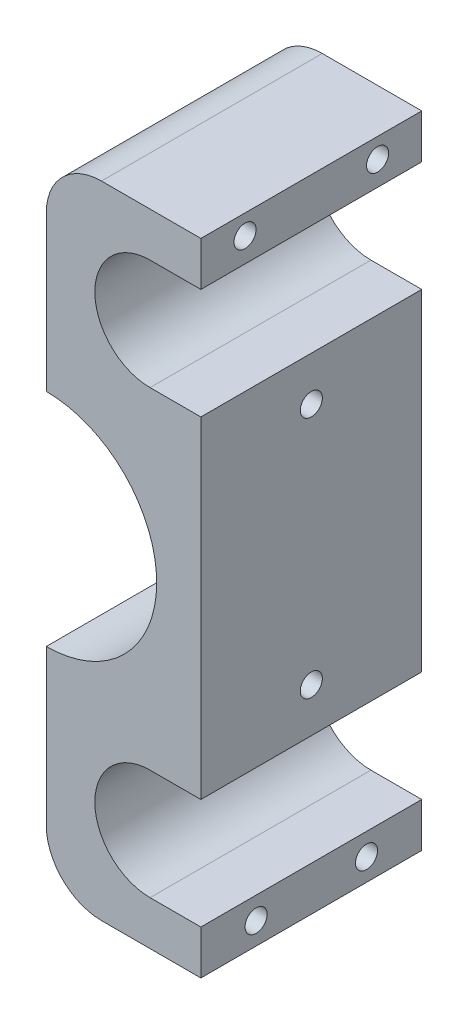
ISO-10303-21;
HEADER;
FILE_DESCRIPTION(('STEP AP214'),'2;1');
FILE_NAME('part.step','',(''),(''),'','','');
FILE_SCHEMA(('AUTOMOTIVE_DESIGN { 1 0 10303 214 1 1 1 1 }'));
ENDSEC;
DATA;
#1=APPLICATION_CONTEXT('core data for automotive mechanical design processes');
#2=APPLICATION_PROTOCOL_DEFINITION('international standard','automotive_design',2000,#1);
#3=PRODUCT_CONTEXT('',#1,'mechanical');
#4=PRODUCT('Part','Part','',(#3));
#5=PRODUCT_RELATED_PRODUCT_CATEGORY('part','',(#4));
#6=PRODUCT_DEFINITION_FORMATION('','',#4);
#7=PRODUCT_DEFINITION_CONTEXT('part definition',#1,'design');
#8=PRODUCT_DEFINITION('design','',#6,#7);
#9=PRODUCT_DEFINITION_SHAPE('','',#8);
#10=(LENGTH_UNIT() NAMED_UNIT(*) SI_UNIT(.MILLI.,.METRE.));
#11=(NAMED_UNIT(*) PLANE_ANGLE_UNIT() SI_UNIT($,.RADIAN.));
#12=(NAMED_UNIT(*) SI_UNIT($,.STERADIAN.) SOLID_ANGLE_UNIT());
#13=UNCERTAINTY_MEASURE_WITH_UNIT(LENGTH_MEASURE(1.E-05),#10,'distance_accuracy_value','');
#14=(GEOMETRIC_REPRESENTATION_CONTEXT(3) GLOBAL_UNCERTAINTY_ASSIGNED_CONTEXT((#13)) GLOBAL_UNIT_ASSIGNED_CONTEXT((#10,
#11,#12)) REPRESENTATION_CONTEXT('',''));
#15=CARTESIAN_POINT('',(0.,0.,0.));
#16=DIRECTION('',(0.,0.,1.));
#17=DIRECTION('',(1.,0.,0.));
#18=AXIS2_PLACEMENT_3D('',#15,#16,#17);
#19=CARTESIAN_POINT('',(-14.,29.,20.));
#20=DIRECTION('',(1.,0.,0.));
#21=DIRECTION('',(0.,0.,-1.));
#22=AXIS2_PLACEMENT_3D('',#19,#20,#21);
#23=PLANE('',#22);
#24=DIRECTION('',(0.,-1.,0.));
#25=VECTOR('',#24,1.);
#26=CARTESIAN_POINT('',(-14.,29.,0.));
#27=LINE('',#26,#25);
#28=CARTESIAN_POINT('',(-14.,24.,0.));
#29=VERTEX_POINT('',#28);
#30=CARTESIAN_POINT('',(-14.,10.,0.));
#31=VERTEX_POINT('',#30);
#32=EDGE_CURVE('E159',#29,#31,#27,.T.);
#33=ORIENTED_EDGE('',*,*,#32,.T.);
#34=DIRECTION('',(0.,0.,1.));
#35=VECTOR('',#34,1.);
#36=CARTESIAN_POINT('',(-14.,10.,-20.));
#37=LINE('',#36,#35);
#38=CARTESIAN_POINT('',(-14.,10.,20.));
#39=VERTEX_POINT('',#38);
#40=EDGE_CURVE('E50',#31,#39,#37,.T.);
#41=ORIENTED_EDGE('',*,*,#40,.T.);
#42=DIRECTION('',(0.,-1.,0.));
#43=VECTOR('',#42,1.);
#44=CARTESIAN_POINT('',(-14.,29.,20.));
#45=LINE('',#44,#43);
#46=CARTESIAN_POINT('',(-14.,24.,20.));
#47=VERTEX_POINT('',#46);
#48=EDGE_CURVE('E156',#47,#39,#45,.T.);
#49=ORIENTED_EDGE('',*,*,#48,.F.);
#50=DIRECTION('',(0.,0.,-1.));
#51=VECTOR('',#50,1.);
#52=CARTESIAN_POINT('',(-14.,24.,20.));
#53=LINE('',#52,#51);
#54=EDGE_CURVE('E235',#47,#29,#53,.T.);
#55=ORIENTED_EDGE('',*,*,#54,.T.);
#56=EDGE_LOOP('',(#33,#41,#49,#55));
#57=FACE_BOUND('',#56,.T.);
#58=ADVANCED_FACE('F35',(#57),#23,.F.);
#59=CARTESIAN_POINT('',(0.,-25.,20.));
#60=DIRECTION('',(-1.,0.,0.));
#61=DIRECTION('',(0.,-1.,0.));
#62=AXIS2_PLACEMENT_3D('',#59,#60,#61);
#63=PLANE('',#62);
#64=CARTESIAN_POINT('',(0.,-27.,5.));
#65=DIRECTION('',(1.,0.,0.));
#66=DIRECTION('',(0.,1.,0.));
#67=AXIS2_PLACEMENT_3D('',#64,#65,#66);
#68=CIRCLE('',#67,1.);
#69=CARTESIAN_POINT('',(0.,-26.,5.));
#70=VERTEX_POINT('',#69);
#71=EDGE_CURVE('E160',#70,#70,#68,.T.);
#72=ORIENTED_EDGE('',*,*,#71,.F.);
#73=EDGE_LOOP('',(#72));
#74=FACE_BOUND('',#73,.T.);
#75=CARTESIAN_POINT('',(0.,-27.,15.));
#76=DIRECTION('',(1.,0.,0.));
#77=DIRECTION('',(0.,1.,0.));
#78=AXIS2_PLACEMENT_3D('',#75,#76,#77);
#79=CIRCLE('',#78,1.);
#80=CARTESIAN_POINT('',(0.,-26.,15.));
#81=VERTEX_POINT('',#80);
#82=EDGE_CURVE('E297',#81,#81,#79,.T.);
#83=ORIENTED_EDGE('',*,*,#82,.F.);
#84=EDGE_LOOP('',(#83));
#85=FACE_BOUND('',#84,.T.);
#86=DIRECTION('',(0.,1.,0.));
#87=VECTOR('',#86,1.);
#88=CARTESIAN_POINT('',(0.,-25.,0.));
#89=LINE('',#88,#87);
#90=CARTESIAN_POINT('',(0.,-29.,0.));
#91=VERTEX_POINT('',#90);
#92=CARTESIAN_POINT('',(0.,-25.,0.));
#93=VERTEX_POINT('',#92);
#94=EDGE_CURVE('E175',#91,#93,#89,.T.);
#95=ORIENTED_EDGE('',*,*,#94,.T.);
#96=DIRECTION('',(0.,0.,-1.));
#97=VECTOR('',#96,1.);
#98=CARTESIAN_POINT('',(0.,-25.,20.));
#99=LINE('',#98,#97);
#100=CARTESIAN_POINT('',(0.,-25.,20.));
#101=VERTEX_POINT('',#100);
#102=EDGE_CURVE('E229',#101,#93,#99,.T.);
#103=ORIENTED_EDGE('',*,*,#102,.F.);
#104=DIRECTION('',(0.,1.,0.));
#105=VECTOR('',#104,1.);
#106=CARTESIAN_POINT('',(0.,-25.,20.));
#107=LINE('',#106,#105);
#108=CARTESIAN_POINT('',(0.,-29.,20.));
#109=VERTEX_POINT('',#108);
#110=EDGE_CURVE('E202',#109,#101,#107,.T.);
#111=ORIENTED_EDGE('',*,*,#110,.F.);
#112=DIRECTION('',(0.,0.,-1.));
#113=VECTOR('',#112,1.);
#114=CARTESIAN_POINT('',(0.,-29.,20.));
#115=LINE('',#114,#113);
#116=EDGE_CURVE('E169',#109,#91,#115,.T.);
#117=ORIENTED_EDGE('',*,*,#116,.T.);
#118=EDGE_LOOP('',(#95,#103,#111,#117));
#119=FACE_BOUND('',#118,.T.);
#120=ADVANCED_FACE('F260',(#74,#85,#119),#63,.F.);
#121=CARTESIAN_POINT('',(-4.59999999999999,-25.,20.));
#122=DIRECTION('',(0.,-1.,0.));
#123=DIRECTION('',(1.,0.,0.));
#124=AXIS2_PLACEMENT_3D('',#121,#122,#123);
#125=PLANE('',#124);
#126=DIRECTION('',(-1.,0.,0.));
#127=VECTOR('',#126,1.);
#128=CARTESIAN_POINT('',(-4.59999999999999,-25.,0.));
#129=LINE('',#128,#127);
#130=CARTESIAN_POINT('',(-4.59999999999999,-25.,0.));
#131=VERTEX_POINT('',#130);
#132=EDGE_CURVE('E178',#93,#131,#129,.T.);
#133=ORIENTED_EDGE('',*,*,#132,.T.);
#134=DIRECTION('',(0.,0.,-1.));
#135=VECTOR('',#134,1.);
#136=CARTESIAN_POINT('',(-4.59999999999999,-25.,20.));
#137=LINE('',#136,#135);
#138=CARTESIAN_POINT('',(-4.59999999999999,-25.,20.));
#139=VERTEX_POINT('',#138);
#140=EDGE_CURVE('E226',#139,#131,#137,.T.);
#141=ORIENTED_EDGE('',*,*,#140,.F.);
#142=DIRECTION('',(-1.,0.,0.));
#143=VECTOR('',#142,1.);
#144=CARTESIAN_POINT('',(-4.59999999999999,-25.,20.));
#145=LINE('',#144,#143);
#146=EDGE_CURVE('E263',#101,#139,#145,.T.);
#147=ORIENTED_EDGE('',*,*,#146,.F.);
#148=ORIENTED_EDGE('',*,*,#102,.T.);
#149=EDGE_LOOP('',(#133,#141,#147,#148));
#150=FACE_BOUND('',#149,.T.);
#151=ADVANCED_FACE('F350',(#150),#125,.F.);
#152=CARTESIAN_POINT('',(-4.59999999999999,-20.,20.));
#153=DIRECTION('',(0.,0.,-1.));
#154=DIRECTION('',(-1.,0.,0.));
#155=AXIS2_PLACEMENT_3D('',#152,#153,#154);
#156=CYLINDRICAL_SURFACE('',#155,5.);
#157=CARTESIAN_POINT('',(-4.59999999999999,-20.,0.));
#158=DIRECTION('',(0.,0.,-1.));
#159=DIRECTION('',(1.,0.,0.));
#160=AXIS2_PLACEMENT_3D('',#157,#158,#159);
#161=CIRCLE('',#160,5.);
#162=CARTESIAN_POINT('',(-4.59999999999999,-15.,0.));
#163=VERTEX_POINT('',#162);
#164=EDGE_CURVE('E181',#131,#163,#161,.T.);
#165=ORIENTED_EDGE('',*,*,#164,.T.);
#166=DIRECTION('',(0.,0.,-1.));
#167=VECTOR('',#166,1.);
#168=CARTESIAN_POINT('',(-4.59999999999999,-15.,20.));
#169=LINE('',#168,#167);
#170=CARTESIAN_POINT('',(-4.59999999999999,-15.,20.));
#171=VERTEX_POINT('',#170);
#172=EDGE_CURVE('E223',#171,#163,#169,.T.);
#173=ORIENTED_EDGE('',*,*,#172,.F.);
#174=CARTESIAN_POINT('',(-4.59999999999999,-20.,20.));
#175=DIRECTION('',(0.,0.,-1.));
#176=DIRECTION('',(1.,0.,0.));
#177=AXIS2_PLACEMENT_3D('',#174,#175,#176);
#178=CIRCLE('',#177,5.);
#179=EDGE_CURVE('E265',#139,#171,#178,.T.);
#180=ORIENTED_EDGE('',*,*,#179,.F.);
#181=ORIENTED_EDGE('',*,*,#140,.T.);
#182=EDGE_LOOP('',(#165,#173,#180,#181));
#183=FACE_BOUND('',#182,.T.);
#184=ADVANCED_FACE('F579',(#183),#156,.F.);
#185=CARTESIAN_POINT('',(-4.59999999999999,-15.,20.));
#186=DIRECTION('',(0.,1.,0.));
#187=DIRECTION('',(-1.,0.,0.));
#188=AXIS2_PLACEMENT_3D('',#185,#186,#187);
#189=PLANE('',#188);
#190=DIRECTION('',(1.,0.,0.));
#191=VECTOR('',#190,1.);
#192=CARTESIAN_POINT('',(-4.59999999999999,-15.,0.));
#193=LINE('',#192,#191);
#194=CARTESIAN_POINT('',(0.,-15.,0.));
#195=VERTEX_POINT('',#194);
#196=EDGE_CURVE('E183',#163,#195,#193,.T.);
#197=ORIENTED_EDGE('',*,*,#196,.T.);
#198=DIRECTION('',(0.,0.,-1.));
#199=VECTOR('',#198,1.);
#200=CARTESIAN_POINT('',(0.,-15.,20.));
#201=LINE('',#200,#199);
#202=CARTESIAN_POINT('',(0.,-15.,20.));
#203=VERTEX_POINT('',#202);
#204=EDGE_CURVE('E220',#203,#195,#201,.T.);
#205=ORIENTED_EDGE('',*,*,#204,.F.);
#206=DIRECTION('',(1.,0.,0.));
#207=VECTOR('',#206,1.);
#208=CARTESIAN_POINT('',(-4.59999999999999,-15.,20.));
#209=LINE('',#208,#207);
#210=EDGE_CURVE('E272',#171,#203,#209,.T.);
#211=ORIENTED_EDGE('',*,*,#210,.F.);
#212=ORIENTED_EDGE('',*,*,#172,.T.);
#213=EDGE_LOOP('',(#197,#205,#211,#212));
#214=FACE_BOUND('',#213,.T.);
#215=ADVANCED_FACE('F571',(#214),#189,.F.);
#216=CARTESIAN_POINT('',(0.,15.,20.));
#217=DIRECTION('',(-1.,0.,0.));
#218=DIRECTION('',(0.,-1.,0.));
#219=AXIS2_PLACEMENT_3D('',#216,#217,#218);
#220=PLANE('',#219);
#221=CARTESIAN_POINT('',(0.,-11.,10.));
#222=DIRECTION('',(1.,0.,0.));
#223=DIRECTION('',(0.,1.,0.));
#224=AXIS2_PLACEMENT_3D('',#221,#222,#223);
#225=CIRCLE('',#224,1.);
#226=CARTESIAN_POINT('',(0.,-10.,10.));
#227=VERTEX_POINT('',#226);
#228=EDGE_CURVE('E303',#227,#227,#225,.T.);
#229=ORIENTED_EDGE('',*,*,#228,.F.);
#230=EDGE_LOOP('',(#229));
#231=FACE_BOUND('',#230,.T.);
#232=CARTESIAN_POINT('',(0.,11.,10.));
#233=DIRECTION('',(1.,0.,0.));
#234=DIRECTION('',(0.,1.,0.));
#235=AXIS2_PLACEMENT_3D('',#232,#233,#234);
#236=CIRCLE('',#235,1.);
#237=CARTESIAN_POINT('',(0.,12.,10.));
#238=VERTEX_POINT('',#237);
#239=EDGE_CURVE('E309',#238,#238,#236,.T.);
#240=ORIENTED_EDGE('',*,*,#239,.F.);
#241=EDGE_LOOP('',(#240));
#242=FACE_BOUND('',#241,.T.);
#243=DIRECTION('',(0.,1.,0.));
#244=VECTOR('',#243,1.);
#245=CARTESIAN_POINT('',(0.,15.,0.));
#246=LINE('',#245,#244);
#247=CARTESIAN_POINT('',(0.,15.,0.));
#248=VERTEX_POINT('',#247);
#249=EDGE_CURVE('E185',#195,#248,#246,.T.);
#250=ORIENTED_EDGE('',*,*,#249,.T.);
#251=DIRECTION('',(0.,0.,-1.));
#252=VECTOR('',#251,1.);
#253=CARTESIAN_POINT('',(0.,15.,20.));
#254=LINE('',#253,#252);
#255=CARTESIAN_POINT('',(0.,15.,20.));
#256=VERTEX_POINT('',#255);
#257=EDGE_CURVE('E217',#256,#248,#254,.T.);
#258=ORIENTED_EDGE('',*,*,#257,.F.);
#259=DIRECTION('',(0.,1.,0.));
#260=VECTOR('',#259,1.);
#261=CARTESIAN_POINT('',(0.,15.,20.));
#262=LINE('',#261,#260);
#263=EDGE_CURVE('E274',#203,#256,#262,.T.);
#264=ORIENTED_EDGE('',*,*,#263,.F.);
#265=ORIENTED_EDGE('',*,*,#204,.T.);
#266=EDGE_LOOP('',(#250,#258,#264,#265));
#267=FACE_BOUND('',#266,.T.);
#268=ADVANCED_FACE('F562',(#231,#242,#267),#220,.F.);
#269=CARTESIAN_POINT('',(-4.6,15.,20.));
#270=DIRECTION('',(0.,-1.,0.));
#271=DIRECTION('',(0.,0.,-1.));
#272=AXIS2_PLACEMENT_3D('',#269,#270,#271);
#273=PLANE('',#272);
#274=DIRECTION('',(-1.,0.,0.));
#275=VECTOR('',#274,1.);
#276=CARTESIAN_POINT('',(-4.6,15.,0.));
#277=LINE('',#276,#275);
#278=CARTESIAN_POINT('',(-4.6,15.,0.));
#279=VERTEX_POINT('',#278);
#280=EDGE_CURVE('E187',#248,#279,#277,.T.);
#281=ORIENTED_EDGE('',*,*,#280,.T.);
#282=DIRECTION('',(0.,0.,-1.));
#283=VECTOR('',#282,1.);
#284=CARTESIAN_POINT('',(-4.6,15.,20.));
#285=LINE('',#284,#283);
#286=CARTESIAN_POINT('',(-4.6,15.,20.));
#287=VERTEX_POINT('',#286);
#288=EDGE_CURVE('E214',#287,#279,#285,.T.);
#289=ORIENTED_EDGE('',*,*,#288,.F.);
#290=DIRECTION('',(-1.,0.,0.));
#291=VECTOR('',#290,1.);
#292=CARTESIAN_POINT('',(-4.6,15.,20.));
#293=LINE('',#292,#291);
#294=EDGE_CURVE('E276',#256,#287,#293,.T.);
#295=ORIENTED_EDGE('',*,*,#294,.F.);
#296=ORIENTED_EDGE('',*,*,#257,.T.);
#297=EDGE_LOOP('',(#281,#289,#295,#296));
#298=FACE_BOUND('',#297,.T.);
#299=ADVANCED_FACE('F553',(#298),#273,.F.);
#300=CARTESIAN_POINT('',(-4.6,20.,20.));
#301=DIRECTION('',(0.,0.,-1.));
#302=DIRECTION('',(-1.,0.,0.));
#303=AXIS2_PLACEMENT_3D('',#300,#301,#302);
#304=CYLINDRICAL_SURFACE('',#303,5.);
#305=CARTESIAN_POINT('',(-4.6,20.,0.));
#306=DIRECTION('',(0.,0.,-1.));
#307=DIRECTION('',(1.,0.,0.));
#308=AXIS2_PLACEMENT_3D('',#305,#306,#307);
#309=CIRCLE('',#308,5.);
#310=CARTESIAN_POINT('',(-4.59999999999999,25.,0.));
#311=VERTEX_POINT('',#310);
#312=EDGE_CURVE('E189',#279,#311,#309,.T.);
#313=ORIENTED_EDGE('',*,*,#312,.T.);
#314=DIRECTION('',(0.,0.,-1.));
#315=VECTOR('',#314,1.);
#316=CARTESIAN_POINT('',(-4.59999999999999,25.,20.));
#317=LINE('',#316,#315);
#318=CARTESIAN_POINT('',(-4.59999999999999,25.,20.));
#319=VERTEX_POINT('',#318);
#320=EDGE_CURVE('E211',#319,#311,#317,.T.);
#321=ORIENTED_EDGE('',*,*,#320,.F.);
#322=CARTESIAN_POINT('',(-4.6,20.,20.));
#323=DIRECTION('',(0.,0.,-1.));
#324=DIRECTION('',(1.,0.,0.));
#325=AXIS2_PLACEMENT_3D('',#322,#323,#324);
#326=CIRCLE('',#325,5.);
#327=EDGE_CURVE('E278',#287,#319,#326,.T.);
#328=ORIENTED_EDGE('',*,*,#327,.F.);
#329=ORIENTED_EDGE('',*,*,#288,.T.);
#330=EDGE_LOOP('',(#313,#321,#328,#329));
#331=FACE_BOUND('',#330,.T.);
#332=ADVANCED_FACE('F544',(#331),#304,.F.);
#333=CARTESIAN_POINT('',(-4.59999999999999,25.,20.));
#334=DIRECTION('',(0.,1.,0.));
#335=DIRECTION('',(0.,0.,1.));
#336=AXIS2_PLACEMENT_3D('',#333,#334,#335);
#337=PLANE('',#336);
#338=DIRECTION('',(1.,0.,0.));
#339=VECTOR('',#338,1.);
#340=CARTESIAN_POINT('',(-4.59999999999999,25.,0.));
#341=LINE('',#340,#339);
#342=CARTESIAN_POINT('',(0.,25.,0.));
#343=VERTEX_POINT('',#342);
#344=EDGE_CURVE('E191',#311,#343,#341,.T.);
#345=ORIENTED_EDGE('',*,*,#344,.T.);
#346=DIRECTION('',(0.,0.,-1.));
#347=VECTOR('',#346,1.);
#348=CARTESIAN_POINT('',(0.,25.,20.));
#349=LINE('',#348,#347);
#350=CARTESIAN_POINT('',(0.,25.,20.));
#351=VERTEX_POINT('',#350);
#352=EDGE_CURVE('E208',#351,#343,#349,.T.);
#353=ORIENTED_EDGE('',*,*,#352,.F.);
#354=DIRECTION('',(1.,0.,0.));
#355=VECTOR('',#354,1.);
#356=CARTESIAN_POINT('',(-4.59999999999999,25.,20.));
#357=LINE('',#356,#355);
#358=EDGE_CURVE('E280',#319,#351,#357,.T.);
#359=ORIENTED_EDGE('',*,*,#358,.F.);
#360=ORIENTED_EDGE('',*,*,#320,.T.);
#361=EDGE_LOOP('',(#345,#353,#359,#360));
#362=FACE_BOUND('',#361,.T.);
#363=ADVANCED_FACE('F334',(#362),#337,.F.);
#364=CARTESIAN_POINT('',(0.,29.,20.));
#365=DIRECTION('',(-1.,0.,0.));
#366=DIRECTION('',(0.,-1.,0.));
#367=AXIS2_PLACEMENT_3D('',#364,#365,#366);
#368=PLANE('',#367);
#369=CARTESIAN_POINT('',(0.,27.2,4.));
#370=DIRECTION('',(1.,0.,0.));
#371=DIRECTION('',(0.,1.,0.));
#372=AXIS2_PLACEMENT_3D('',#369,#370,#371);
#373=CIRCLE('',#372,1.);
#374=CARTESIAN_POINT('',(0.,28.2,4.));
#375=VERTEX_POINT('',#374);
#376=EDGE_CURVE('E315',#375,#375,#373,.T.);
#377=ORIENTED_EDGE('',*,*,#376,.F.);
#378=EDGE_LOOP('',(#377));
#379=FACE_BOUND('',#378,.T.);
#380=CARTESIAN_POINT('',(0.,27.2,16.));
#381=DIRECTION('',(1.,0.,0.));
#382=DIRECTION('',(0.,1.,0.));
#383=AXIS2_PLACEMENT_3D('',#380,#381,#382);
#384=CIRCLE('',#383,1.);
#385=CARTESIAN_POINT('',(0.,28.2,16.));
#386=VERTEX_POINT('',#385);
#387=EDGE_CURVE('E268',#386,#386,#384,.T.);
#388=ORIENTED_EDGE('',*,*,#387,.F.);
#389=EDGE_LOOP('',(#388));
#390=FACE_BOUND('',#389,.T.);
#391=DIRECTION('',(0.,1.,0.));
#392=VECTOR('',#391,1.);
#393=CARTESIAN_POINT('',(0.,29.,0.));
#394=LINE('',#393,#392);
#395=CARTESIAN_POINT('',(0.,29.,0.));
#396=VERTEX_POINT('',#395);
#397=EDGE_CURVE('E193',#343,#396,#394,.T.);
#398=ORIENTED_EDGE('',*,*,#397,.T.);
#399=DIRECTION('',(0.,0.,-1.));
#400=VECTOR('',#399,1.);
#401=CARTESIAN_POINT('',(0.,29.,20.));
#402=LINE('',#401,#400);
#403=CARTESIAN_POINT('',(0.,29.,20.));
#404=VERTEX_POINT('',#403);
#405=EDGE_CURVE('E205',#404,#396,#402,.T.);
#406=ORIENTED_EDGE('',*,*,#405,.F.);
#407=DIRECTION('',(0.,1.,0.));
#408=VECTOR('',#407,1.);
#409=CARTESIAN_POINT('',(0.,29.,20.));
#410=LINE('',#409,#408);
#411=EDGE_CURVE('E281',#351,#404,#410,.T.);
#412=ORIENTED_EDGE('',*,*,#411,.F.);
#413=ORIENTED_EDGE('',*,*,#352,.T.);
#414=EDGE_LOOP('',(#398,#406,#412,#413));
#415=FACE_BOUND('',#414,.T.);
#416=ADVANCED_FACE('F330',(#379,#390,#415),#368,.F.);
#417=CARTESIAN_POINT('',(0.,29.,20.));
#418=DIRECTION('',(0.,-1.,0.));
#419=DIRECTION('',(0.,0.,-1.));
#420=AXIS2_PLACEMENT_3D('',#417,#418,#419);
#421=PLANE('',#420);
#422=DIRECTION('',(-1.,0.,0.));
#423=VECTOR('',#422,1.);
#424=CARTESIAN_POINT('',(0.,29.,0.));
#425=LINE('',#424,#423);
#426=CARTESIAN_POINT('',(-9.,29.,0.));
#427=VERTEX_POINT('',#426);
#428=EDGE_CURVE('E195',#396,#427,#425,.T.);
#429=ORIENTED_EDGE('',*,*,#428,.T.);
#430=DIRECTION('',(0.,0.,-1.));
#431=VECTOR('',#430,1.);
#432=CARTESIAN_POINT('',(-9.,29.,20.));
#433=LINE('',#432,#431);
#434=CARTESIAN_POINT('',(-9.,29.,20.));
#435=VERTEX_POINT('',#434);
#436=EDGE_CURVE('E242',#427,#435,#433,.F.);
#437=ORIENTED_EDGE('',*,*,#436,.T.);
#438=DIRECTION('',(-1.,0.,0.));
#439=VECTOR('',#438,1.);
#440=CARTESIAN_POINT('',(0.,29.,20.));
#441=LINE('',#440,#439);
#442=EDGE_CURVE('E171',#404,#435,#441,.T.);
#443=ORIENTED_EDGE('',*,*,#442,.F.);
#444=ORIENTED_EDGE('',*,*,#405,.T.);
#445=EDGE_LOOP('',(#429,#437,#443,#444));
#446=FACE_BOUND('',#445,.T.);
#447=ADVANCED_FACE('F333',(#446),#421,.F.);
#448=CARTESIAN_POINT('',(-14.,-10.,20.));
#449=VERTEX_POINT('',#448);
#450=CARTESIAN_POINT('',(-14.,-24.,20.));
#451=VERTEX_POINT('',#450);
#452=EDGE_CURVE('E167',#449,#451,#45,.T.);
#453=ORIENTED_EDGE('',*,*,#452,.F.);
#454=DIRECTION('',(0.,0.,1.));
#455=VECTOR('',#454,1.);
#456=CARTESIAN_POINT('',(-14.,-10.,-20.));
#457=LINE('',#456,#455);
#458=CARTESIAN_POINT('',(-14.,-10.,0.));
#459=VERTEX_POINT('',#458);
#460=EDGE_CURVE('E148',#449,#459,#457,.F.);
#461=ORIENTED_EDGE('',*,*,#460,.T.);
#462=CARTESIAN_POINT('',(-14.,-24.,0.));
#463=VERTEX_POINT('',#462);
#464=EDGE_CURVE('E198',#459,#463,#27,.T.);
#465=ORIENTED_EDGE('',*,*,#464,.T.);
#466=DIRECTION('',(0.,0.,-1.));
#467=VECTOR('',#466,1.);
#468=CARTESIAN_POINT('',(-14.,-24.,20.));
#469=LINE('',#468,#467);
#470=EDGE_CURVE('E232',#463,#451,#469,.F.);
#471=ORIENTED_EDGE('',*,*,#470,.T.);
#472=EDGE_LOOP('',(#453,#461,#465,#471));
#473=FACE_BOUND('',#472,.T.);
#474=ADVANCED_FACE('F291',(#473),#23,.F.);
#475=CARTESIAN_POINT('',(0.,-29.,20.));
#476=DIRECTION('',(0.,1.,0.));
#477=DIRECTION('',(0.,0.,1.));
#478=AXIS2_PLACEMENT_3D('',#475,#476,#477);
#479=PLANE('',#478);
#480=DIRECTION('',(1.,0.,0.));
#481=VECTOR('',#480,1.);
#482=CARTESIAN_POINT('',(0.,-29.,20.));
#483=LINE('',#482,#481);
#484=CARTESIAN_POINT('',(-9.,-29.,20.));
#485=VERTEX_POINT('',#484);
#486=EDGE_CURVE('E166',#485,#109,#483,.T.);
#487=ORIENTED_EDGE('',*,*,#486,.F.);
#488=DIRECTION('',(0.,0.,-1.));
#489=VECTOR('',#488,1.);
#490=CARTESIAN_POINT('',(-9.,-29.,20.));
#491=LINE('',#490,#489);
#492=CARTESIAN_POINT('',(-9.,-29.,0.));
#493=VERTEX_POINT('',#492);
#494=EDGE_CURVE('E43',#485,#493,#491,.T.);
#495=ORIENTED_EDGE('',*,*,#494,.T.);
#496=DIRECTION('',(1.,0.,0.));
#497=VECTOR('',#496,1.);
#498=CARTESIAN_POINT('',(0.,-29.,0.));
#499=LINE('',#498,#497);
#500=EDGE_CURVE('E200',#493,#91,#499,.T.);
#501=ORIENTED_EDGE('',*,*,#500,.T.);
#502=ORIENTED_EDGE('',*,*,#116,.F.);
#503=EDGE_LOOP('',(#487,#495,#501,#502));
#504=FACE_BOUND('',#503,.T.);
#505=ADVANCED_FACE('F249',(#504),#479,.F.);
#506=CARTESIAN_POINT('',(-4.6,20.,20.));
#507=DIRECTION('',(0.,0.,1.));
#508=DIRECTION('',(1.,0.,0.));
#509=AXIS2_PLACEMENT_3D('',#506,#507,#508);
#510=PLANE('',#509);
#511=CARTESIAN_POINT('',(-14.,0.,20.));
#512=DIRECTION('',(0.,0.,1.));
#513=DIRECTION('',(1.,0.,0.));
#514=AXIS2_PLACEMENT_3D('',#511,#512,#513);
#515=CIRCLE('',#514,10.);
#516=EDGE_CURVE('E145',#449,#39,#515,.T.);
#517=ORIENTED_EDGE('',*,*,#516,.F.);
#518=ORIENTED_EDGE('',*,*,#452,.T.);
#519=CARTESIAN_POINT('',(-9.,-24.,20.));
#520=DIRECTION('',(0.,0.,1.));
#521=DIRECTION('',(1.,0.,0.));
#522=AXIS2_PLACEMENT_3D('',#519,#520,#521);
#523=CIRCLE('',#522,5.);
#524=EDGE_CURVE('E57',#451,#485,#523,.T.);
#525=ORIENTED_EDGE('',*,*,#524,.T.);
#526=ORIENTED_EDGE('',*,*,#486,.T.);
#527=ORIENTED_EDGE('',*,*,#110,.T.);
#528=ORIENTED_EDGE('',*,*,#146,.T.);
#529=ORIENTED_EDGE('',*,*,#179,.T.);
#530=ORIENTED_EDGE('',*,*,#210,.T.);
#531=ORIENTED_EDGE('',*,*,#263,.T.);
#532=ORIENTED_EDGE('',*,*,#294,.T.);
#533=ORIENTED_EDGE('',*,*,#327,.T.);
#534=ORIENTED_EDGE('',*,*,#358,.T.);
#535=ORIENTED_EDGE('',*,*,#411,.T.);
#536=ORIENTED_EDGE('',*,*,#442,.T.);
#537=CARTESIAN_POINT('',(-9.,24.,20.));
#538=DIRECTION('',(0.,0.,1.));
#539=DIRECTION('',(1.,0.,0.));
#540=AXIS2_PLACEMENT_3D('',#537,#538,#539);
#541=CIRCLE('',#540,5.);
#542=EDGE_CURVE('E165',#435,#47,#541,.T.);
#543=ORIENTED_EDGE('',*,*,#542,.T.);
#544=ORIENTED_EDGE('',*,*,#48,.T.);
#545=EDGE_LOOP('',(#517,#518,#525,#526,#527,#528,#529,#530,#531,#532,#533,#534,#535,#536,#543,#544));
#546=FACE_BOUND('',#545,.T.);
#547=ADVANCED_FACE('F162',(#546),#510,.T.);
#548=CARTESIAN_POINT('',(-4.6,20.,0.));
#549=DIRECTION('',(0.,0.,1.));
#550=DIRECTION('',(1.,0.,0.));
#551=AXIS2_PLACEMENT_3D('',#548,#549,#550);
#552=PLANE('',#551);
#553=ORIENTED_EDGE('',*,*,#464,.F.);
#554=CARTESIAN_POINT('',(-14.,0.,0.));
#555=DIRECTION('',(0.,0.,1.));
#556=DIRECTION('',(1.,0.,0.));
#557=AXIS2_PLACEMENT_3D('',#554,#555,#556);
#558=CIRCLE('',#557,10.);
#559=EDGE_CURVE('E11',#459,#31,#558,.T.);
#560=ORIENTED_EDGE('',*,*,#559,.T.);
#561=ORIENTED_EDGE('',*,*,#32,.F.);
#562=CARTESIAN_POINT('',(-9.,24.,0.));
#563=DIRECTION('',(0.,0.,1.));
#564=DIRECTION('',(1.,0.,0.));
#565=AXIS2_PLACEMENT_3D('',#562,#563,#564);
#566=CIRCLE('',#565,5.);
#567=EDGE_CURVE('E240',#29,#427,#566,.F.);
#568=ORIENTED_EDGE('',*,*,#567,.T.);
#569=ORIENTED_EDGE('',*,*,#428,.F.);
#570=ORIENTED_EDGE('',*,*,#397,.F.);
#571=ORIENTED_EDGE('',*,*,#344,.F.);
#572=ORIENTED_EDGE('',*,*,#312,.F.);
#573=ORIENTED_EDGE('',*,*,#280,.F.);
#574=ORIENTED_EDGE('',*,*,#249,.F.);
#575=ORIENTED_EDGE('',*,*,#196,.F.);
#576=ORIENTED_EDGE('',*,*,#164,.F.);
#577=ORIENTED_EDGE('',*,*,#132,.F.);
#578=ORIENTED_EDGE('',*,*,#94,.F.);
#579=ORIENTED_EDGE('',*,*,#500,.F.);
#580=CARTESIAN_POINT('',(-9.,-24.,0.));
#581=DIRECTION('',(0.,0.,1.));
#582=DIRECTION('',(1.,0.,0.));
#583=AXIS2_PLACEMENT_3D('',#580,#581,#582);
#584=CIRCLE('',#583,5.);
#585=EDGE_CURVE('E237',#493,#463,#584,.F.);
#586=ORIENTED_EDGE('',*,*,#585,.T.);
#587=EDGE_LOOP('',(#553,#560,#561,#568,#569,#570,#571,#572,#573,#574,#575,#576,#577,#578,#579,#586));
#588=FACE_BOUND('',#587,.T.);
#589=ADVANCED_FACE('F255',(#588),#552,.F.);
#590=CARTESIAN_POINT('',(-9.,24.,20.));
#591=DIRECTION('',(0.,0.,-1.));
#592=DIRECTION('',(-1.,0.,0.));
#593=AXIS2_PLACEMENT_3D('',#590,#591,#592);
#594=CYLINDRICAL_SURFACE('',#593,5.);
#595=ORIENTED_EDGE('',*,*,#542,.F.);
#596=ORIENTED_EDGE('',*,*,#436,.F.);
#597=ORIENTED_EDGE('',*,*,#567,.F.);
#598=ORIENTED_EDGE('',*,*,#54,.F.);
#599=EDGE_LOOP('',(#595,#596,#597,#598));
#600=FACE_BOUND('',#599,.T.);
#601=ADVANCED_FACE('F288',(#600),#594,.T.);
#602=CARTESIAN_POINT('',(-9.,-24.,20.));
#603=DIRECTION('',(0.,0.,-1.));
#604=DIRECTION('',(-1.,0.,0.));
#605=AXIS2_PLACEMENT_3D('',#602,#603,#604);
#606=CYLINDRICAL_SURFACE('',#605,5.);
#607=ORIENTED_EDGE('',*,*,#524,.F.);
#608=ORIENTED_EDGE('',*,*,#470,.F.);
#609=ORIENTED_EDGE('',*,*,#585,.F.);
#610=ORIENTED_EDGE('',*,*,#494,.F.);
#611=EDGE_LOOP('',(#607,#608,#609,#610));
#612=FACE_BOUND('',#611,.T.);
#613=ADVANCED_FACE('F37',(#612),#606,.T.);
#614=CARTESIAN_POINT('',(-10.,27.2,16.));
#615=DIRECTION('',(1.,0.,0.));
#616=DIRECTION('',(0.,1.,0.));
#617=AXIS2_PLACEMENT_3D('',#614,#615,#616);
#618=CYLINDRICAL_SURFACE('',#617,1.);
#619=CARTESIAN_POINT('',(-10.,27.2,16.));
#620=DIRECTION('',(1.,0.,0.));
#621=DIRECTION('',(0.,1.,0.));
#622=AXIS2_PLACEMENT_3D('',#619,#620,#621);
#623=CIRCLE('',#622,1.);
#624=CARTESIAN_POINT('',(-10.,28.2,16.));
#625=VERTEX_POINT('',#624);
#626=EDGE_CURVE('E179',#625,#625,#623,.T.);
#627=ORIENTED_EDGE('',*,*,#626,.F.);
#628=EDGE_LOOP('',(#627));
#629=FACE_BOUND('',#628,.T.);
#630=ORIENTED_EDGE('',*,*,#387,.T.);
#631=EDGE_LOOP('',(#630));
#632=FACE_BOUND('',#631,.T.);
#633=ADVANCED_FACE('F328',(#629,#632),#618,.F.);
#634=CARTESIAN_POINT('',(-10.,27.2,16.));
#635=DIRECTION('',(1.,0.,0.));
#636=DIRECTION('',(0.,1.,0.));
#637=AXIS2_PLACEMENT_3D('',#634,#635,#636);
#638=PLANE('',#637);
#639=ORIENTED_EDGE('',*,*,#626,.T.);
#640=EDGE_LOOP('',(#639));
#641=FACE_BOUND('',#640,.T.);
#642=ADVANCED_FACE('F362',(#641),#638,.T.);
#643=CARTESIAN_POINT('',(-10.,27.2,4.));
#644=DIRECTION('',(1.,0.,0.));
#645=DIRECTION('',(0.,1.,0.));
#646=AXIS2_PLACEMENT_3D('',#643,#644,#645);
#647=CYLINDRICAL_SURFACE('',#646,1.);
#648=CARTESIAN_POINT('',(-10.,27.2,4.));
#649=DIRECTION('',(1.,0.,0.));
#650=DIRECTION('',(0.,1.,0.));
#651=AXIS2_PLACEMENT_3D('',#648,#649,#650);
#652=CIRCLE('',#651,1.);
#653=CARTESIAN_POINT('',(-10.,28.2,4.));
#654=VERTEX_POINT('',#653);
#655=EDGE_CURVE('E318',#654,#654,#652,.T.);
#656=ORIENTED_EDGE('',*,*,#655,.F.);
#657=EDGE_LOOP('',(#656));
#658=FACE_BOUND('',#657,.T.);
#659=ORIENTED_EDGE('',*,*,#376,.T.);
#660=EDGE_LOOP('',(#659));
#661=FACE_BOUND('',#660,.T.);
#662=ADVANCED_FACE('F366',(#658,#661),#647,.F.);
#663=CARTESIAN_POINT('',(-10.,27.2,4.));
#664=DIRECTION('',(1.,0.,0.));
#665=DIRECTION('',(0.,1.,0.));
#666=AXIS2_PLACEMENT_3D('',#663,#664,#665);
#667=PLANE('',#666);
#668=ORIENTED_EDGE('',*,*,#655,.T.);
#669=EDGE_LOOP('',(#668));
#670=FACE_BOUND('',#669,.T.);
#671=ADVANCED_FACE('F369',(#670),#667,.T.);
#672=CARTESIAN_POINT('',(-10.,11.,10.));
#673=DIRECTION('',(1.,0.,0.));
#674=DIRECTION('',(0.,1.,0.));
#675=AXIS2_PLACEMENT_3D('',#672,#673,#674);
#676=CYLINDRICAL_SURFACE('',#675,1.);
#677=CARTESIAN_POINT('',(-10.,11.,10.));
#678=DIRECTION('',(1.,0.,0.));
#679=DIRECTION('',(0.,1.,0.));
#680=AXIS2_PLACEMENT_3D('',#677,#678,#679);
#681=CIRCLE('',#680,1.);
#682=CARTESIAN_POINT('',(-10.,12.,10.));
#683=VERTEX_POINT('',#682);
#684=EDGE_CURVE('E312',#683,#683,#681,.T.);
#685=ORIENTED_EDGE('',*,*,#684,.F.);
#686=EDGE_LOOP('',(#685));
#687=FACE_BOUND('',#686,.T.);
#688=ORIENTED_EDGE('',*,*,#239,.T.);
#689=EDGE_LOOP('',(#688));
#690=FACE_BOUND('',#689,.T.);
#691=ADVANCED_FACE('F373',(#687,#690),#676,.F.);
#692=CARTESIAN_POINT('',(-10.,11.,10.));
#693=DIRECTION('',(1.,0.,0.));
#694=DIRECTION('',(0.,1.,0.));
#695=AXIS2_PLACEMENT_3D('',#692,#693,#694);
#696=PLANE('',#695);
#697=ORIENTED_EDGE('',*,*,#684,.T.);
#698=EDGE_LOOP('',(#697));
#699=FACE_BOUND('',#698,.T.);
#700=ADVANCED_FACE('F377',(#699),#696,.T.);
#701=CARTESIAN_POINT('',(-10.,-11.,10.));
#702=DIRECTION('',(1.,0.,0.));
#703=DIRECTION('',(0.,1.,0.));
#704=AXIS2_PLACEMENT_3D('',#701,#702,#703);
#705=CYLINDRICAL_SURFACE('',#704,1.);
#706=CARTESIAN_POINT('',(-10.,-11.,10.));
#707=DIRECTION('',(1.,0.,0.));
#708=DIRECTION('',(0.,1.,0.));
#709=AXIS2_PLACEMENT_3D('',#706,#707,#708);
#710=CIRCLE('',#709,1.);
#711=CARTESIAN_POINT('',(-10.,-10.,10.));
#712=VERTEX_POINT('',#711);
#713=EDGE_CURVE('E306',#712,#712,#710,.T.);
#714=ORIENTED_EDGE('',*,*,#713,.F.);
#715=EDGE_LOOP('',(#714));
#716=FACE_BOUND('',#715,.T.);
#717=ORIENTED_EDGE('',*,*,#228,.T.);
#718=EDGE_LOOP('',(#717));
#719=FACE_BOUND('',#718,.T.);
#720=ADVANCED_FACE('F381',(#716,#719),#705,.F.);
#721=CARTESIAN_POINT('',(-10.,-11.,10.));
#722=DIRECTION('',(1.,0.,0.));
#723=DIRECTION('',(0.,1.,0.));
#724=AXIS2_PLACEMENT_3D('',#721,#722,#723);
#725=PLANE('',#724);
#726=ORIENTED_EDGE('',*,*,#713,.T.);
#727=EDGE_LOOP('',(#726));
#728=FACE_BOUND('',#727,.T.);
#729=ADVANCED_FACE('F385',(#728),#725,.T.);
#730=CARTESIAN_POINT('',(-10.,-27.,15.));
#731=DIRECTION('',(1.,0.,0.));
#732=DIRECTION('',(0.,1.,0.));
#733=AXIS2_PLACEMENT_3D('',#730,#731,#732);
#734=CYLINDRICAL_SURFACE('',#733,1.);
#735=CARTESIAN_POINT('',(-10.,-27.,15.));
#736=DIRECTION('',(1.,0.,0.));
#737=DIRECTION('',(0.,1.,0.));
#738=AXIS2_PLACEMENT_3D('',#735,#736,#737);
#739=CIRCLE('',#738,1.);
#740=CARTESIAN_POINT('',(-10.,-26.,15.));
#741=VERTEX_POINT('',#740);
#742=EDGE_CURVE('E300',#741,#741,#739,.T.);
#743=ORIENTED_EDGE('',*,*,#742,.F.);
#744=EDGE_LOOP('',(#743));
#745=FACE_BOUND('',#744,.T.);
#746=ORIENTED_EDGE('',*,*,#82,.T.);
#747=EDGE_LOOP('',(#746));
#748=FACE_BOUND('',#747,.T.);
#749=ADVANCED_FACE('F389',(#745,#748),#734,.F.);
#750=CARTESIAN_POINT('',(-10.,-27.,15.));
#751=DIRECTION('',(1.,0.,0.));
#752=DIRECTION('',(0.,1.,0.));
#753=AXIS2_PLACEMENT_3D('',#750,#751,#752);
#754=PLANE('',#753);
#755=ORIENTED_EDGE('',*,*,#742,.T.);
#756=EDGE_LOOP('',(#755));
#757=FACE_BOUND('',#756,.T.);
#758=ADVANCED_FACE('F393',(#757),#754,.T.);
#759=CARTESIAN_POINT('',(-10.,-27.,5.));
#760=DIRECTION('',(1.,0.,0.));
#761=DIRECTION('',(0.,1.,0.));
#762=AXIS2_PLACEMENT_3D('',#759,#760,#761);
#763=CYLINDRICAL_SURFACE('',#762,1.);
#764=CARTESIAN_POINT('',(-10.,-27.,5.));
#765=DIRECTION('',(1.,0.,0.));
#766=DIRECTION('',(0.,1.,0.));
#767=AXIS2_PLACEMENT_3D('',#764,#765,#766);
#768=CIRCLE('',#767,1.);
#769=CARTESIAN_POINT('',(-10.,-26.,5.));
#770=VERTEX_POINT('',#769);
#771=EDGE_CURVE('E294',#770,#770,#768,.T.);
#772=ORIENTED_EDGE('',*,*,#771,.F.);
#773=EDGE_LOOP('',(#772));
#774=FACE_BOUND('',#773,.T.);
#775=ORIENTED_EDGE('',*,*,#71,.T.);
#776=EDGE_LOOP('',(#775));
#777=FACE_BOUND('',#776,.T.);
#778=ADVANCED_FACE('F397',(#774,#777),#763,.F.);
#779=CARTESIAN_POINT('',(-10.,-27.,5.));
#780=DIRECTION('',(1.,0.,0.));
#781=DIRECTION('',(0.,1.,0.));
#782=AXIS2_PLACEMENT_3D('',#779,#780,#781);
#783=PLANE('',#782);
#784=ORIENTED_EDGE('',*,*,#771,.T.);
#785=EDGE_LOOP('',(#784));
#786=FACE_BOUND('',#785,.T.);
#787=ADVANCED_FACE('F401',(#786),#783,.T.);
#788=CARTESIAN_POINT('',(-14.,0.,-20.));
#789=DIRECTION('',(0.,0.,1.));
#790=DIRECTION('',(1.,0.,0.));
#791=AXIS2_PLACEMENT_3D('',#788,#789,#790);
#792=CYLINDRICAL_SURFACE('',#791,10.);
#793=ORIENTED_EDGE('',*,*,#559,.F.);
#794=ORIENTED_EDGE('',*,*,#460,.F.);
#795=ORIENTED_EDGE('',*,*,#516,.T.);
#796=ORIENTED_EDGE('',*,*,#40,.F.);
#797=EDGE_LOOP('',(#793,#794,#795,#796));
#798=FACE_BOUND('',#797,.T.);
#799=ADVANCED_FACE('F146',(#798),#792,.F.);
#800=CLOSED_SHELL('',(#58,#120,#151,#184,#215,#268,#299,#332,#363,#416,#447,#474,#505,#547,#589,
#601,#613,#633,#642,#662,#671,#691,#700,#720,#729,#749,#758,#778,#787,#799));
#801=MANIFOLD_SOLID_BREP('B2',#800);
#802=ADVANCED_BREP_SHAPE_REPRESENTATION('',(#18,#801),#14);
#803=SHAPE_DEFINITION_REPRESENTATION(#9,#802);
ENDSEC;
END-ISO-10303-21;
